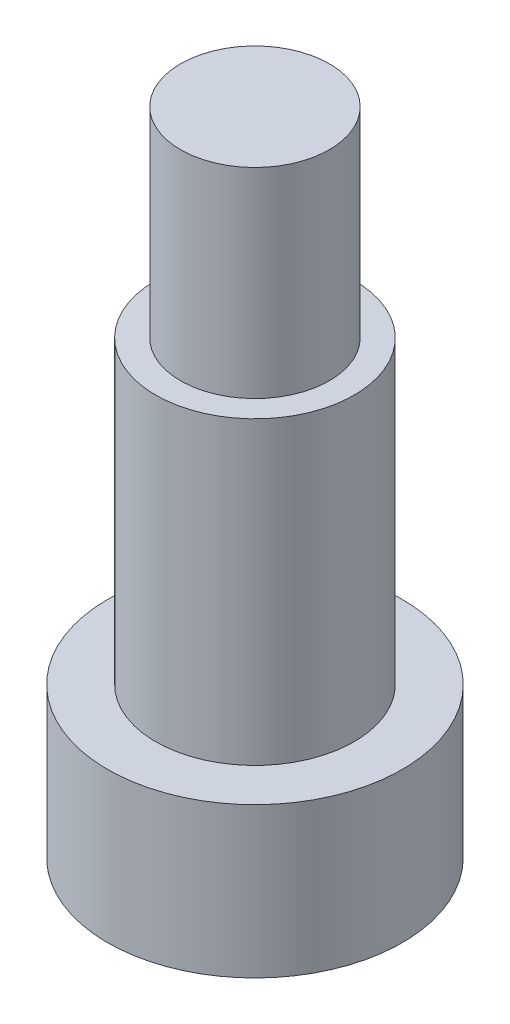
ISO-10303-21;
HEADER;
FILE_DESCRIPTION(('STEP AP214'),'2;1');
FILE_NAME('part.step','',(''),(''),'','','');
FILE_SCHEMA(('AUTOMOTIVE_DESIGN { 1 0 10303 214 1 1 1 1 }'));
ENDSEC;
DATA;
#1=APPLICATION_CONTEXT('core data for automotive mechanical design processes');
#2=APPLICATION_PROTOCOL_DEFINITION('international standard','automotive_design',2000,#1);
#3=PRODUCT_CONTEXT('',#1,'mechanical');
#4=PRODUCT('Part','Part','',(#3));
#5=PRODUCT_RELATED_PRODUCT_CATEGORY('part','',(#4));
#6=PRODUCT_DEFINITION_FORMATION('','',#4);
#7=PRODUCT_DEFINITION_CONTEXT('part definition',#1,'design');
#8=PRODUCT_DEFINITION('design','',#6,#7);
#9=PRODUCT_DEFINITION_SHAPE('','',#8);
#10=(LENGTH_UNIT() NAMED_UNIT(*) SI_UNIT(.MILLI.,.METRE.));
#11=(NAMED_UNIT(*) PLANE_ANGLE_UNIT() SI_UNIT($,.RADIAN.));
#12=(NAMED_UNIT(*) SI_UNIT($,.STERADIAN.) SOLID_ANGLE_UNIT());
#13=UNCERTAINTY_MEASURE_WITH_UNIT(LENGTH_MEASURE(1.E-05),#10,'distance_accuracy_value','');
#14=(GEOMETRIC_REPRESENTATION_CONTEXT(3) GLOBAL_UNCERTAINTY_ASSIGNED_CONTEXT((#13)) GLOBAL_UNIT_ASSIGNED_CONTEXT((#10,
#11,#12)) REPRESENTATION_CONTEXT('',''));
#15=CARTESIAN_POINT('',(0.,0.,0.));
#16=DIRECTION('',(0.,0.,1.));
#17=DIRECTION('',(1.,0.,0.));
#18=AXIS2_PLACEMENT_3D('',#15,#16,#17);
#19=CARTESIAN_POINT('',(0.,0.,0.));
#20=DIRECTION('',(0.,1.,0.));
#21=DIRECTION('',(-1.,0.,0.));
#22=AXIS2_PLACEMENT_3D('',#19,#20,#21);
#23=PLANE('',#22);
#24=CARTESIAN_POINT('',(0.,0.,0.));
#25=DIRECTION('',(0.,1.,0.));
#26=DIRECTION('',(-1.,0.,0.));
#27=AXIS2_PLACEMENT_3D('',#24,#25,#26);
#28=CIRCLE('',#27,4.6736);
#29=CARTESIAN_POINT('',(-4.6736,0.,0.));
#30=VERTEX_POINT('',#29);
#31=EDGE_CURVE('E10',#30,#30,#28,.T.);
#32=ORIENTED_EDGE('',*,*,#31,.F.);
#33=EDGE_LOOP('',(#32));
#34=FACE_BOUND('',#33,.T.);
#35=ADVANCED_FACE('F358',(#34),#23,.F.);
#36=CARTESIAN_POINT('',(0.,31.2952966558792,0.));
#37=DIRECTION('',(0.,1.,0.));
#38=DIRECTION('',(-1.,0.,0.));
#39=AXIS2_PLACEMENT_3D('',#36,#37,#38);
#40=CYLINDRICAL_SURFACE('',#39,4.6736);
#41=CARTESIAN_POINT('',(0.,4.7625,0.));
#42=DIRECTION('',(0.,1.,0.));
#43=DIRECTION('',(-1.,0.,0.));
#44=AXIS2_PLACEMENT_3D('',#41,#42,#43);
#45=CIRCLE('',#44,4.6736);
#46=CARTESIAN_POINT('',(-4.6736,4.7625,0.));
#47=VERTEX_POINT('',#46);
#48=EDGE_CURVE('E364',#47,#47,#45,.T.);
#49=ORIENTED_EDGE('',*,*,#48,.F.);
#50=EDGE_LOOP('',(#49));
#51=FACE_BOUND('',#50,.T.);
#52=ORIENTED_EDGE('',*,*,#31,.T.);
#53=EDGE_LOOP('',(#52));
#54=FACE_BOUND('',#53,.T.);
#55=ADVANCED_FACE('F406',(#51,#54),#40,.T.);
#56=CARTESIAN_POINT('',(4.6736,4.7625,0.));
#57=DIRECTION('',(0.,-1.,0.));
#58=DIRECTION('',(1.,0.,0.));
#59=AXIS2_PLACEMENT_3D('',#56,#57,#58);
#60=PLANE('',#59);
#61=CARTESIAN_POINT('',(0.,4.7625,0.));
#62=DIRECTION('',(0.,1.,0.));
#63=DIRECTION('',(-1.,0.,0.));
#64=AXIS2_PLACEMENT_3D('',#61,#62,#63);
#65=CIRCLE('',#64,3.1496);
#66=CARTESIAN_POINT('',(-3.1496,4.7625,0.));
#67=VERTEX_POINT('',#66);
#68=EDGE_CURVE('E368',#67,#67,#65,.T.);
#69=ORIENTED_EDGE('',*,*,#68,.F.);
#70=EDGE_LOOP('',(#69));
#71=FACE_BOUND('',#70,.T.);
#72=ORIENTED_EDGE('',*,*,#48,.T.);
#73=EDGE_LOOP('',(#72));
#74=FACE_BOUND('',#73,.T.);
#75=ADVANCED_FACE('F401',(#71,#74),#60,.F.);
#76=CARTESIAN_POINT('',(0.,31.2952966558792,0.));
#77=DIRECTION('',(0.,1.,0.));
#78=DIRECTION('',(-1.,0.,0.));
#79=AXIS2_PLACEMENT_3D('',#76,#77,#78);
#80=CYLINDRICAL_SURFACE('',#79,3.1496);
#81=CARTESIAN_POINT('',(0.,14.2875,0.));
#82=DIRECTION('',(0.,1.,0.));
#83=DIRECTION('',(-1.,0.,0.));
#84=AXIS2_PLACEMENT_3D('',#81,#82,#83);
#85=CIRCLE('',#84,3.1496);
#86=CARTESIAN_POINT('',(-3.14960000000001,14.2875,0.));
#87=VERTEX_POINT('',#86);
#88=EDGE_CURVE('E372',#87,#87,#85,.T.);
#89=ORIENTED_EDGE('',*,*,#88,.F.);
#90=EDGE_LOOP('',(#89));
#91=FACE_BOUND('',#90,.T.);
#92=ORIENTED_EDGE('',*,*,#68,.T.);
#93=EDGE_LOOP('',(#92));
#94=FACE_BOUND('',#93,.T.);
#95=ADVANCED_FACE('F395',(#91,#94),#80,.T.);
#96=CARTESIAN_POINT('',(3.1496,14.2875,0.));
#97=DIRECTION('',(0.,-1.,0.));
#98=DIRECTION('',(1.,0.,0.));
#99=AXIS2_PLACEMENT_3D('',#96,#97,#98);
#100=PLANE('',#99);
#101=CARTESIAN_POINT('',(0.,14.2875,0.));
#102=DIRECTION('',(0.,1.,0.));
#103=DIRECTION('',(-1.,0.,0.));
#104=AXIS2_PLACEMENT_3D('',#101,#102,#103);
#105=CIRCLE('',#104,2.3622);
#106=CARTESIAN_POINT('',(-2.36220000000001,14.2875,0.));
#107=VERTEX_POINT('',#106);
#108=EDGE_CURVE('E377',#107,#107,#105,.T.);
#109=ORIENTED_EDGE('',*,*,#108,.F.);
#110=EDGE_LOOP('',(#109));
#111=FACE_BOUND('',#110,.T.);
#112=ORIENTED_EDGE('',*,*,#88,.T.);
#113=EDGE_LOOP('',(#112));
#114=FACE_BOUND('',#113,.T.);
#115=ADVANCED_FACE('F389',(#111,#114),#100,.F.);
#116=CARTESIAN_POINT('',(0.,31.2952966558792,0.));
#117=DIRECTION('',(0.,1.,0.));
#118=DIRECTION('',(-1.,0.,0.));
#119=AXIS2_PLACEMENT_3D('',#116,#117,#118);
#120=CYLINDRICAL_SURFACE('',#119,2.3622);
#121=CARTESIAN_POINT('',(0.,20.6375,0.));
#122=DIRECTION('',(0.,1.,0.));
#123=DIRECTION('',(-1.,0.,0.));
#124=AXIS2_PLACEMENT_3D('',#121,#122,#123);
#125=CIRCLE('',#124,2.3622);
#126=CARTESIAN_POINT('',(-2.36220000000001,20.6375,0.));
#127=VERTEX_POINT('',#126);
#128=EDGE_CURVE('E380',#127,#127,#125,.T.);
#129=ORIENTED_EDGE('',*,*,#128,.F.);
#130=EDGE_LOOP('',(#129));
#131=FACE_BOUND('',#130,.T.);
#132=ORIENTED_EDGE('',*,*,#108,.T.);
#133=EDGE_LOOP('',(#132));
#134=FACE_BOUND('',#133,.T.);
#135=ADVANCED_FACE('F386',(#131,#134),#120,.T.);
#136=CARTESIAN_POINT('',(2.3622,20.6375,0.));
#137=DIRECTION('',(0.,-1.,0.));
#138=DIRECTION('',(1.,0.,0.));
#139=AXIS2_PLACEMENT_3D('',#136,#137,#138);
#140=PLANE('',#139);
#141=ORIENTED_EDGE('',*,*,#128,.T.);
#142=EDGE_LOOP('',(#141));
#143=FACE_BOUND('',#142,.T.);
#144=ADVANCED_FACE('F384',(#143),#140,.F.);
#145=CLOSED_SHELL('',(#35,#55,#75,#95,#115,#135,#144));
#146=MANIFOLD_SOLID_BREP('B2',#145);
#147=ADVANCED_BREP_SHAPE_REPRESENTATION('',(#18,#146),#14);
#148=SHAPE_DEFINITION_REPRESENTATION(#9,#147);
ENDSEC;
END-ISO-10303-21;
